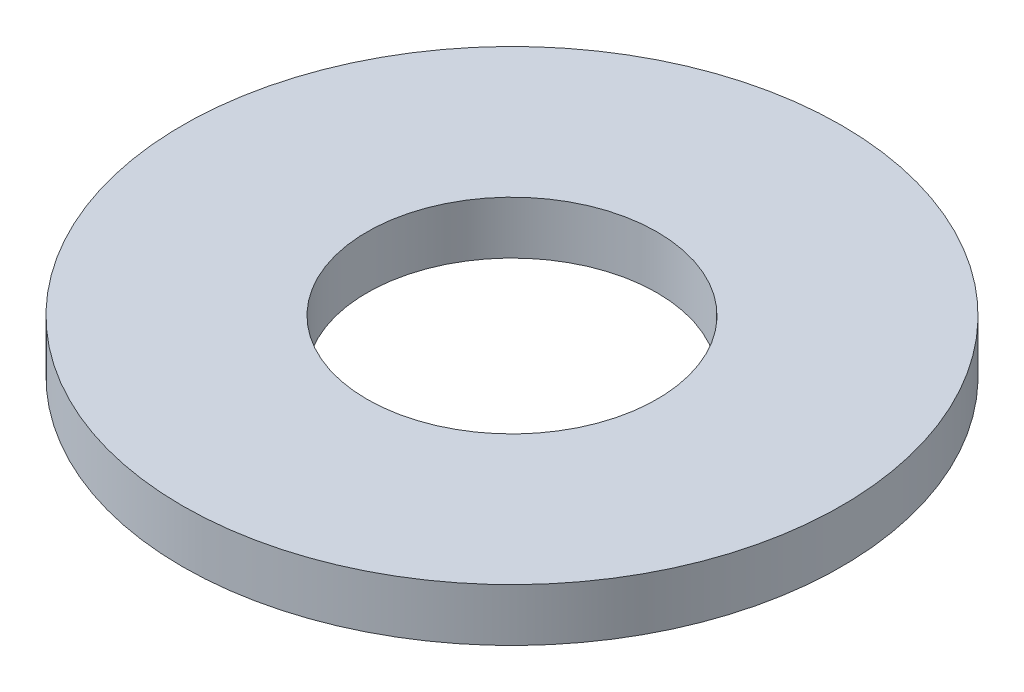
ISO-10303-21;
HEADER;
FILE_DESCRIPTION(('STEP AP214'),'2;1');
FILE_NAME('part.step','',(''),(''),'','','');
FILE_SCHEMA(('AUTOMOTIVE_DESIGN { 1 0 10303 214 1 1 1 1 }'));
ENDSEC;
DATA;
#1=APPLICATION_CONTEXT('core data for automotive mechanical design processes');
#2=APPLICATION_PROTOCOL_DEFINITION('international standard','automotive_design',2000,#1);
#3=PRODUCT_CONTEXT('',#1,'mechanical');
#4=PRODUCT('Part','Part','',(#3));
#5=PRODUCT_RELATED_PRODUCT_CATEGORY('part','',(#4));
#6=PRODUCT_DEFINITION_FORMATION('','',#4);
#7=PRODUCT_DEFINITION_CONTEXT('part definition',#1,'design');
#8=PRODUCT_DEFINITION('design','',#6,#7);
#9=PRODUCT_DEFINITION_SHAPE('','',#8);
#10=(LENGTH_UNIT() NAMED_UNIT(*) SI_UNIT(.MILLI.,.METRE.));
#11=(NAMED_UNIT(*) PLANE_ANGLE_UNIT() SI_UNIT($,.RADIAN.));
#12=(NAMED_UNIT(*) SI_UNIT($,.STERADIAN.) SOLID_ANGLE_UNIT());
#13=UNCERTAINTY_MEASURE_WITH_UNIT(LENGTH_MEASURE(1.E-05),#10,'distance_accuracy_value','');
#14=(GEOMETRIC_REPRESENTATION_CONTEXT(3) GLOBAL_UNCERTAINTY_ASSIGNED_CONTEXT((#13)) GLOBAL_UNIT_ASSIGNED_CONTEXT((#10,
#11,#12)) REPRESENTATION_CONTEXT('',''));
#15=CARTESIAN_POINT('',(0.,0.,0.));
#16=DIRECTION('',(0.,0.,1.));
#17=DIRECTION('',(1.,0.,0.));
#18=AXIS2_PLACEMENT_3D('',#15,#16,#17);
#19=CARTESIAN_POINT('',(0.,0.4,0.));
#20=DIRECTION('',(0.,-1.,0.));
#21=DIRECTION('',(0.,0.,-1.));
#22=AXIS2_PLACEMENT_3D('',#19,#20,#21);
#23=CYLINDRICAL_SURFACE('',#22,2.5);
#24=CARTESIAN_POINT('',(0.,0.4,0.));
#25=DIRECTION('',(0.,1.,0.));
#26=DIRECTION('',(0.,0.,1.));
#27=AXIS2_PLACEMENT_3D('',#24,#25,#26);
#28=CIRCLE('',#27,2.5);
#29=CARTESIAN_POINT('',(0.,0.4,2.5));
#30=VERTEX_POINT('',#29);
#31=EDGE_CURVE('E10',#30,#30,#28,.T.);
#32=ORIENTED_EDGE('',*,*,#31,.F.);
#33=EDGE_LOOP('',(#32));
#34=FACE_BOUND('',#33,.T.);
#35=CARTESIAN_POINT('',(0.,0.,0.));
#36=DIRECTION('',(0.,1.,0.));
#37=DIRECTION('',(0.,0.,1.));
#38=AXIS2_PLACEMENT_3D('',#35,#36,#37);
#39=CIRCLE('',#38,2.5);
#40=CARTESIAN_POINT('',(0.,0.,2.5));
#41=VERTEX_POINT('',#40);
#42=EDGE_CURVE('E41',#41,#41,#39,.T.);
#43=ORIENTED_EDGE('',*,*,#42,.T.);
#44=EDGE_LOOP('',(#43));
#45=FACE_BOUND('',#44,.T.);
#46=ADVANCED_FACE('F38',(#34,#45),#23,.T.);
#47=CARTESIAN_POINT('',(0.,0.4,0.));
#48=DIRECTION('',(0.,1.,0.));
#49=DIRECTION('',(0.,0.,1.));
#50=AXIS2_PLACEMENT_3D('',#47,#48,#49);
#51=PLANE('',#50);
#52=CARTESIAN_POINT('',(0.,0.4,0.));
#53=DIRECTION('',(0.,1.,0.));
#54=DIRECTION('',(0.,0.,1.));
#55=AXIS2_PLACEMENT_3D('',#52,#53,#54);
#56=CIRCLE('',#55,1.1);
#57=CARTESIAN_POINT('',(0.,0.4,1.1));
#58=VERTEX_POINT('',#57);
#59=EDGE_CURVE('E52',#58,#58,#56,.T.);
#60=ORIENTED_EDGE('',*,*,#59,.F.);
#61=EDGE_LOOP('',(#60));
#62=FACE_BOUND('',#61,.T.);
#63=ORIENTED_EDGE('',*,*,#31,.T.);
#64=EDGE_LOOP('',(#63));
#65=FACE_BOUND('',#64,.T.);
#66=ADVANCED_FACE('F67',(#62,#65),#51,.T.);
#67=CARTESIAN_POINT('',(0.,0.,0.));
#68=DIRECTION('',(0.,1.,0.));
#69=DIRECTION('',(0.,0.,1.));
#70=AXIS2_PLACEMENT_3D('',#67,#68,#69);
#71=PLANE('',#70);
#72=CARTESIAN_POINT('',(0.,0.,0.));
#73=DIRECTION('',(0.,1.,0.));
#74=DIRECTION('',(0.,0.,1.));
#75=AXIS2_PLACEMENT_3D('',#72,#73,#74);
#76=CIRCLE('',#75,1.1);
#77=CARTESIAN_POINT('',(0.,0.,1.1));
#78=VERTEX_POINT('',#77);
#79=EDGE_CURVE('E50',#78,#78,#76,.T.);
#80=ORIENTED_EDGE('',*,*,#79,.T.);
#81=EDGE_LOOP('',(#80));
#82=FACE_BOUND('',#81,.T.);
#83=ORIENTED_EDGE('',*,*,#42,.F.);
#84=EDGE_LOOP('',(#83));
#85=FACE_BOUND('',#84,.T.);
#86=ADVANCED_FACE('F58',(#82,#85),#71,.F.);
#87=CARTESIAN_POINT('',(0.,0.,0.));
#88=DIRECTION('',(0.,1.,0.));
#89=DIRECTION('',(0.,0.,1.));
#90=AXIS2_PLACEMENT_3D('',#87,#88,#89);
#91=CYLINDRICAL_SURFACE('',#90,1.1);
#92=ORIENTED_EDGE('',*,*,#79,.F.);
#93=EDGE_LOOP('',(#92));
#94=FACE_BOUND('',#93,.T.);
#95=ORIENTED_EDGE('',*,*,#59,.T.);
#96=EDGE_LOOP('',(#95));
#97=FACE_BOUND('',#96,.T.);
#98=ADVANCED_FACE('F61',(#94,#97),#91,.F.);
#99=CLOSED_SHELL('',(#46,#66,#86,#98));
#100=MANIFOLD_SOLID_BREP('B2',#99);
#101=ADVANCED_BREP_SHAPE_REPRESENTATION('',(#18,#100),#14);
#102=SHAPE_DEFINITION_REPRESENTATION(#9,#101);
ENDSEC;
END-ISO-10303-21;
